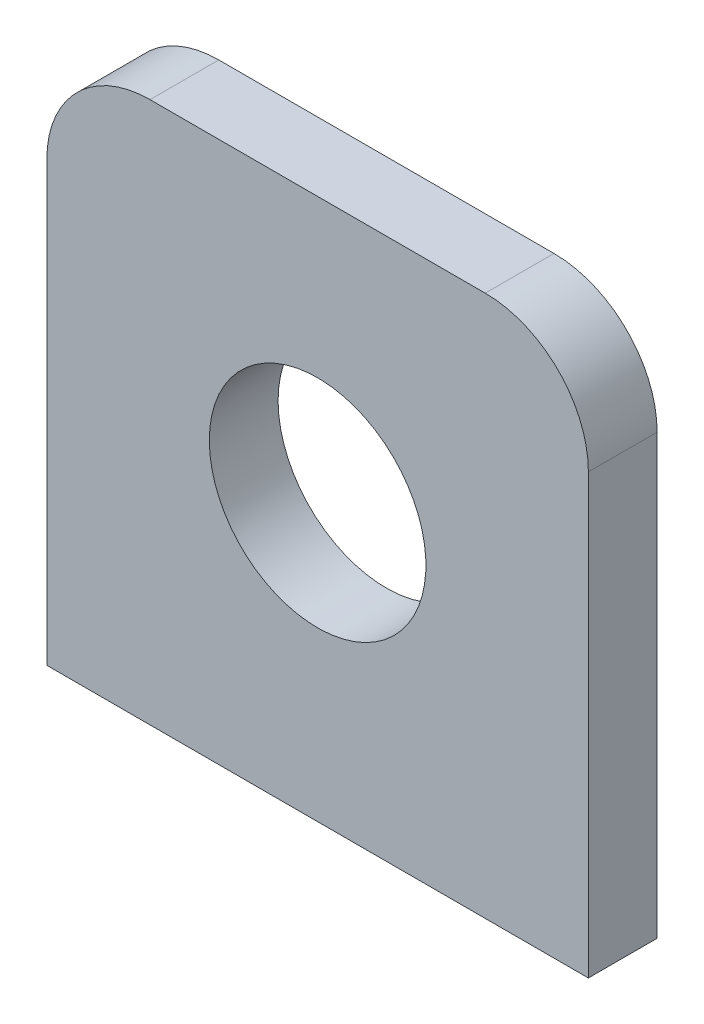
ISO-10303-21;
HEADER;
FILE_DESCRIPTION(('STEP AP214'),'2;1');
FILE_NAME('part.step','',(''),(''),'','','');
FILE_SCHEMA(('AUTOMOTIVE_DESIGN { 1 0 10303 214 1 1 1 1 }'));
ENDSEC;
DATA;
#1=APPLICATION_CONTEXT('core data for automotive mechanical design processes');
#2=APPLICATION_PROTOCOL_DEFINITION('international standard','automotive_design',2000,#1);
#3=PRODUCT_CONTEXT('',#1,'mechanical');
#4=PRODUCT('Part','Part','',(#3));
#5=PRODUCT_RELATED_PRODUCT_CATEGORY('part','',(#4));
#6=PRODUCT_DEFINITION_FORMATION('','',#4);
#7=PRODUCT_DEFINITION_CONTEXT('part definition',#1,'design');
#8=PRODUCT_DEFINITION('design','',#6,#7);
#9=PRODUCT_DEFINITION_SHAPE('','',#8);
#10=(LENGTH_UNIT() NAMED_UNIT(*) SI_UNIT(.MILLI.,.METRE.));
#11=(NAMED_UNIT(*) PLANE_ANGLE_UNIT() SI_UNIT($,.RADIAN.));
#12=(NAMED_UNIT(*) SI_UNIT($,.STERADIAN.) SOLID_ANGLE_UNIT());
#13=UNCERTAINTY_MEASURE_WITH_UNIT(LENGTH_MEASURE(1.E-05),#10,'distance_accuracy_value','');
#14=(GEOMETRIC_REPRESENTATION_CONTEXT(3) GLOBAL_UNCERTAINTY_ASSIGNED_CONTEXT((#13)) GLOBAL_UNIT_ASSIGNED_CONTEXT((#10,
#11,#12)) REPRESENTATION_CONTEXT('',''));
#15=CARTESIAN_POINT('',(0.,0.,0.));
#16=DIRECTION('',(0.,0.,1.));
#17=DIRECTION('',(1.,0.,0.));
#18=AXIS2_PLACEMENT_3D('',#15,#16,#17);
#19=CARTESIAN_POINT('',(-13.,0.,0.));
#20=DIRECTION('',(0.,-1.,0.));
#21=DIRECTION('',(0.,0.,-1.));
#22=AXIS2_PLACEMENT_3D('',#19,#20,#21);
#23=PLANE('',#22);
#24=CARTESIAN_POINT('',(-5.5,0.,3.175));
#25=DIRECTION('',(0.,-1.,0.));
#26=DIRECTION('',(0.,0.,-1.));
#27=AXIS2_PLACEMENT_3D('',#24,#25,#26);
#28=CIRCLE('',#27,1.64999999999999);
#29=CARTESIAN_POINT('',(-5.5,0.,1.52500000000001));
#30=VERTEX_POINT('',#29);
#31=EDGE_CURVE('E104',#30,#30,#28,.T.);
#32=ORIENTED_EDGE('',*,*,#31,.F.);
#33=EDGE_LOOP('',(#32));
#34=FACE_BOUND('',#33,.T.);
#35=CARTESIAN_POINT('',(29.5,0.,3.175));
#36=DIRECTION('',(0.,-1.,0.));
#37=DIRECTION('',(0.,0.,-1.));
#38=AXIS2_PLACEMENT_3D('',#35,#36,#37);
#39=CIRCLE('',#38,1.64999999999999);
#40=CARTESIAN_POINT('',(29.5,0.,1.52500000000001));
#41=VERTEX_POINT('',#40);
#42=EDGE_CURVE('E103',#41,#41,#39,.T.);
#43=ORIENTED_EDGE('',*,*,#42,.F.);
#44=EDGE_LOOP('',(#43));
#45=FACE_BOUND('',#44,.T.);
#46=DIRECTION('',(1.,0.,0.));
#47=VECTOR('',#46,1.);
#48=CARTESIAN_POINT('',(-13.,0.,6.35));
#49=LINE('',#48,#47);
#50=CARTESIAN_POINT('',(-13.,0.,6.35));
#51=VERTEX_POINT('',#50);
#52=CARTESIAN_POINT('',(37.,0.,6.35));
#53=VERTEX_POINT('',#52);
#54=EDGE_CURVE('E120',#51,#53,#49,.T.);
#55=ORIENTED_EDGE('',*,*,#54,.F.);
#56=DIRECTION('',(0.,0.,1.));
#57=VECTOR('',#56,1.);
#58=CARTESIAN_POINT('',(-13.,0.,0.));
#59=LINE('',#58,#57);
#60=CARTESIAN_POINT('',(-13.,0.,0.));
#61=VERTEX_POINT('',#60);
#62=EDGE_CURVE('E142',#61,#51,#59,.T.);
#63=ORIENTED_EDGE('',*,*,#62,.F.);
#64=DIRECTION('',(1.,0.,0.));
#65=VECTOR('',#64,1.);
#66=CARTESIAN_POINT('',(-13.,0.,0.));
#67=LINE('',#66,#65);
#68=CARTESIAN_POINT('',(37.,0.,0.));
#69=VERTEX_POINT('',#68);
#70=EDGE_CURVE('E121',#61,#69,#67,.T.);
#71=ORIENTED_EDGE('',*,*,#70,.T.);
#72=DIRECTION('',(0.,0.,1.));
#73=VECTOR('',#72,1.);
#74=CARTESIAN_POINT('',(37.,0.,0.));
#75=LINE('',#74,#73);
#76=EDGE_CURVE('E132',#69,#53,#75,.T.);
#77=ORIENTED_EDGE('',*,*,#76,.T.);
#78=EDGE_LOOP('',(#55,#63,#71,#77));
#79=FACE_BOUND('',#78,.T.);
#80=ADVANCED_FACE('F33',(#34,#45,#79),#23,.T.);
#81=CARTESIAN_POINT('',(-13.,50.,0.));
#82=DIRECTION('',(-1.,0.,0.));
#83=DIRECTION('',(0.,0.,1.));
#84=AXIS2_PLACEMENT_3D('',#81,#82,#83);
#85=PLANE('',#84);
#86=DIRECTION('',(0.,-1.,0.));
#87=VECTOR('',#86,1.);
#88=CARTESIAN_POINT('',(-13.,50.,6.35));
#89=LINE('',#88,#87);
#90=CARTESIAN_POINT('',(-13.,40.475,6.35));
#91=VERTEX_POINT('',#90);
#92=EDGE_CURVE('E125',#91,#51,#89,.T.);
#93=ORIENTED_EDGE('',*,*,#92,.F.);
#94=DIRECTION('',(0.,0.,1.));
#95=VECTOR('',#94,1.);
#96=CARTESIAN_POINT('',(-13.,40.475,0.));
#97=LINE('',#96,#95);
#98=CARTESIAN_POINT('',(-13.,40.475,0.));
#99=VERTEX_POINT('',#98);
#100=EDGE_CURVE('E56',#91,#99,#97,.F.);
#101=ORIENTED_EDGE('',*,*,#100,.T.);
#102=DIRECTION('',(0.,-1.,0.));
#103=VECTOR('',#102,1.);
#104=CARTESIAN_POINT('',(-13.,50.,0.));
#105=LINE('',#104,#103);
#106=EDGE_CURVE('E130',#99,#61,#105,.T.);
#107=ORIENTED_EDGE('',*,*,#106,.T.);
#108=ORIENTED_EDGE('',*,*,#62,.T.);
#109=EDGE_LOOP('',(#93,#101,#107,#108));
#110=FACE_BOUND('',#109,.T.);
#111=ADVANCED_FACE('F168',(#110),#85,.T.);
#112=CARTESIAN_POINT('',(37.,50.,0.));
#113=DIRECTION('',(0.,1.,0.));
#114=DIRECTION('',(-1.,0.,0.));
#115=AXIS2_PLACEMENT_3D('',#112,#113,#114);
#116=PLANE('',#115);
#117=DIRECTION('',(-1.,0.,0.));
#118=VECTOR('',#117,1.);
#119=CARTESIAN_POINT('',(37.,50.,0.));
#120=LINE('',#119,#118);
#121=CARTESIAN_POINT('',(27.475,50.,0.));
#122=VERTEX_POINT('',#121);
#123=CARTESIAN_POINT('',(-3.47500000000001,50.,0.));
#124=VERTEX_POINT('',#123);
#125=EDGE_CURVE('E127',#122,#124,#120,.T.);
#126=ORIENTED_EDGE('',*,*,#125,.T.);
#127=DIRECTION('',(0.,0.,1.));
#128=VECTOR('',#127,1.);
#129=CARTESIAN_POINT('',(-3.47500000000001,50.,0.));
#130=LINE('',#129,#128);
#131=CARTESIAN_POINT('',(-3.47500000000001,50.,6.35));
#132=VERTEX_POINT('',#131);
#133=EDGE_CURVE('E148',#124,#132,#130,.T.);
#134=ORIENTED_EDGE('',*,*,#133,.T.);
#135=DIRECTION('',(-1.,0.,0.));
#136=VECTOR('',#135,1.);
#137=CARTESIAN_POINT('',(37.,50.,6.35));
#138=LINE('',#137,#136);
#139=CARTESIAN_POINT('',(27.475,50.,6.35));
#140=VERTEX_POINT('',#139);
#141=EDGE_CURVE('E138',#140,#132,#138,.T.);
#142=ORIENTED_EDGE('',*,*,#141,.F.);
#143=DIRECTION('',(0.,0.,1.));
#144=VECTOR('',#143,1.);
#145=CARTESIAN_POINT('',(27.475,50.,0.));
#146=LINE('',#145,#144);
#147=EDGE_CURVE('E145',#140,#122,#146,.F.);
#148=ORIENTED_EDGE('',*,*,#147,.T.);
#149=EDGE_LOOP('',(#126,#134,#142,#148));
#150=FACE_BOUND('',#149,.T.);
#151=ADVANCED_FACE('F162',(#150),#116,.T.);
#152=CARTESIAN_POINT('',(37.,0.,0.));
#153=DIRECTION('',(1.,0.,0.));
#154=DIRECTION('',(0.,0.,-1.));
#155=AXIS2_PLACEMENT_3D('',#152,#153,#154);
#156=PLANE('',#155);
#157=DIRECTION('',(0.,1.,0.));
#158=VECTOR('',#157,1.);
#159=CARTESIAN_POINT('',(37.,0.,0.));
#160=LINE('',#159,#158);
#161=CARTESIAN_POINT('',(37.,40.475,0.));
#162=VERTEX_POINT('',#161);
#163=EDGE_CURVE('E124',#69,#162,#160,.T.);
#164=ORIENTED_EDGE('',*,*,#163,.T.);
#165=DIRECTION('',(0.,0.,1.));
#166=VECTOR('',#165,1.);
#167=CARTESIAN_POINT('',(37.,40.475,0.));
#168=LINE('',#167,#166);
#169=CARTESIAN_POINT('',(37.,40.475,6.35));
#170=VERTEX_POINT('',#169);
#171=EDGE_CURVE('E11',#162,#170,#168,.T.);
#172=ORIENTED_EDGE('',*,*,#171,.T.);
#173=DIRECTION('',(0.,1.,0.));
#174=VECTOR('',#173,1.);
#175=CARTESIAN_POINT('',(37.,0.,6.35));
#176=LINE('',#175,#174);
#177=EDGE_CURVE('E135',#53,#170,#176,.T.);
#178=ORIENTED_EDGE('',*,*,#177,.F.);
#179=ORIENTED_EDGE('',*,*,#76,.F.);
#180=EDGE_LOOP('',(#164,#172,#178,#179));
#181=FACE_BOUND('',#180,.T.);
#182=ADVANCED_FACE('F174',(#181),#156,.T.);
#183=CARTESIAN_POINT('',(0.,0.,0.));
#184=DIRECTION('',(0.,0.,1.));
#185=DIRECTION('',(1.,0.,0.));
#186=AXIS2_PLACEMENT_3D('',#183,#184,#185);
#187=PLANE('',#186);
#188=CARTESIAN_POINT('',(12.,25.5,0.));
#189=DIRECTION('',(0.,0.,-1.));
#190=DIRECTION('',(-1.,0.,0.));
#191=AXIS2_PLACEMENT_3D('',#188,#189,#190);
#192=CIRCLE('',#191,10.);
#193=CARTESIAN_POINT('',(2.,25.5,0.));
#194=VERTEX_POINT('',#193);
#195=EDGE_CURVE('E114',#194,#194,#192,.T.);
#196=ORIENTED_EDGE('',*,*,#195,.F.);
#197=EDGE_LOOP('',(#196));
#198=FACE_BOUND('',#197,.T.);
#199=ORIENTED_EDGE('',*,*,#106,.F.);
#200=CARTESIAN_POINT('',(-3.47500000000001,40.475,0.));
#201=DIRECTION('',(0.,0.,1.));
#202=DIRECTION('',(1.,0.,0.));
#203=AXIS2_PLACEMENT_3D('',#200,#201,#202);
#204=CIRCLE('',#203,9.525);
#205=EDGE_CURVE('E41',#99,#124,#204,.F.);
#206=ORIENTED_EDGE('',*,*,#205,.T.);
#207=ORIENTED_EDGE('',*,*,#125,.F.);
#208=CARTESIAN_POINT('',(27.475,40.475,0.));
#209=DIRECTION('',(0.,0.,1.));
#210=DIRECTION('',(1.,0.,0.));
#211=AXIS2_PLACEMENT_3D('',#208,#209,#210);
#212=CIRCLE('',#211,9.525);
#213=EDGE_CURVE('E48',#122,#162,#212,.F.);
#214=ORIENTED_EDGE('',*,*,#213,.T.);
#215=ORIENTED_EDGE('',*,*,#163,.F.);
#216=ORIENTED_EDGE('',*,*,#70,.F.);
#217=EDGE_LOOP('',(#199,#206,#207,#214,#215,#216));
#218=FACE_BOUND('',#217,.T.);
#219=ADVANCED_FACE('F157',(#198,#218),#187,.F.);
#220=CARTESIAN_POINT('',(0.,0.,6.35));
#221=DIRECTION('',(0.,0.,1.));
#222=DIRECTION('',(1.,0.,0.));
#223=AXIS2_PLACEMENT_3D('',#220,#221,#222);
#224=PLANE('',#223);
#225=CARTESIAN_POINT('',(12.,25.5,6.35));
#226=DIRECTION('',(0.,0.,-1.));
#227=DIRECTION('',(-1.,0.,0.));
#228=AXIS2_PLACEMENT_3D('',#225,#226,#227);
#229=CIRCLE('',#228,10.);
#230=CARTESIAN_POINT('',(2.,25.5,6.35));
#231=VERTEX_POINT('',#230);
#232=EDGE_CURVE('E117',#231,#231,#229,.T.);
#233=ORIENTED_EDGE('',*,*,#232,.T.);
#234=EDGE_LOOP('',(#233));
#235=FACE_BOUND('',#234,.T.);
#236=ORIENTED_EDGE('',*,*,#141,.T.);
#237=CARTESIAN_POINT('',(-3.47500000000001,40.475,6.35));
#238=DIRECTION('',(0.,0.,1.));
#239=DIRECTION('',(1.,0.,0.));
#240=AXIS2_PLACEMENT_3D('',#237,#238,#239);
#241=CIRCLE('',#240,9.525);
#242=EDGE_CURVE('E153',#132,#91,#241,.T.);
#243=ORIENTED_EDGE('',*,*,#242,.T.);
#244=ORIENTED_EDGE('',*,*,#92,.T.);
#245=ORIENTED_EDGE('',*,*,#54,.T.);
#246=ORIENTED_EDGE('',*,*,#177,.T.);
#247=CARTESIAN_POINT('',(27.475,40.475,6.35));
#248=DIRECTION('',(0.,0.,1.));
#249=DIRECTION('',(1.,0.,0.));
#250=AXIS2_PLACEMENT_3D('',#247,#248,#249);
#251=CIRCLE('',#250,9.525);
#252=EDGE_CURVE('E151',#170,#140,#251,.T.);
#253=ORIENTED_EDGE('',*,*,#252,.T.);
#254=EDGE_LOOP('',(#236,#243,#244,#245,#246,#253));
#255=FACE_BOUND('',#254,.T.);
#256=ADVANCED_FACE('F167',(#235,#255),#224,.T.);
#257=CARTESIAN_POINT('',(12.,25.5,0.));
#258=DIRECTION('',(0.,0.,-1.));
#259=DIRECTION('',(-1.,0.,0.));
#260=AXIS2_PLACEMENT_3D('',#257,#258,#259);
#261=CYLINDRICAL_SURFACE('',#260,10.);
#262=ORIENTED_EDGE('',*,*,#232,.F.);
#263=EDGE_LOOP('',(#262));
#264=FACE_BOUND('',#263,.T.);
#265=ORIENTED_EDGE('',*,*,#195,.T.);
#266=EDGE_LOOP('',(#265));
#267=FACE_BOUND('',#266,.T.);
#268=ADVANCED_FACE('F197',(#264,#267),#261,.F.);
#269=CARTESIAN_POINT('',(29.5,9.1,3.175));
#270=DIRECTION('',(0.,-1.,0.));
#271=DIRECTION('',(0.,0.,-1.));
#272=AXIS2_PLACEMENT_3D('',#269,#270,#271);
#273=CONICAL_SURFACE('',#272,1.64999999999999,1.02974425867665);
#274=CARTESIAN_POINT('',(29.5,10.0914200213955,3.175));
#275=VERTEX_POINT('',#274);
#276=VERTEX_LOOP('',#275);
#277=FACE_BOUND('',#276,.T.);
#278=CARTESIAN_POINT('',(29.5,9.1,3.175));
#279=DIRECTION('',(0.,-1.,0.));
#280=DIRECTION('',(0.,0.,-1.));
#281=AXIS2_PLACEMENT_3D('',#278,#279,#280);
#282=CIRCLE('',#281,1.64999999999999);
#283=CARTESIAN_POINT('',(29.5,9.1,1.52500000000001));
#284=VERTEX_POINT('',#283);
#285=EDGE_CURVE('E107',#284,#284,#282,.T.);
#286=ORIENTED_EDGE('',*,*,#285,.T.);
#287=EDGE_LOOP('',(#286));
#288=FACE_BOUND('',#287,.T.);
#289=ADVANCED_FACE('F204',(#277,#288),#273,.F.);
#290=CARTESIAN_POINT('',(29.5,0.,3.175));
#291=DIRECTION('',(0.,-1.,0.));
#292=DIRECTION('',(0.,0.,-1.));
#293=AXIS2_PLACEMENT_3D('',#290,#291,#292);
#294=CYLINDRICAL_SURFACE('',#293,1.64999999999999);
#295=ORIENTED_EDGE('',*,*,#285,.F.);
#296=EDGE_LOOP('',(#295));
#297=FACE_BOUND('',#296,.T.);
#298=ORIENTED_EDGE('',*,*,#42,.T.);
#299=EDGE_LOOP('',(#298));
#300=FACE_BOUND('',#299,.T.);
#301=ADVANCED_FACE('F97',(#297,#300),#294,.F.);
#302=CARTESIAN_POINT('',(-5.5,9.1,3.175));
#303=DIRECTION('',(0.,-1.,0.));
#304=DIRECTION('',(0.,0.,-1.));
#305=AXIS2_PLACEMENT_3D('',#302,#303,#304);
#306=CONICAL_SURFACE('',#305,1.64999999999999,1.02974425867665);
#307=CARTESIAN_POINT('',(-5.5,10.0914200213955,3.175));
#308=VERTEX_POINT('',#307);
#309=VERTEX_LOOP('',#308);
#310=FACE_BOUND('',#309,.T.);
#311=CARTESIAN_POINT('',(-5.5,9.1,3.175));
#312=DIRECTION('',(0.,-1.,0.));
#313=DIRECTION('',(0.,0.,-1.));
#314=AXIS2_PLACEMENT_3D('',#311,#312,#313);
#315=CIRCLE('',#314,1.64999999999999);
#316=CARTESIAN_POINT('',(-5.5,9.1,1.52500000000001));
#317=VERTEX_POINT('',#316);
#318=EDGE_CURVE('E101',#317,#317,#315,.T.);
#319=ORIENTED_EDGE('',*,*,#318,.T.);
#320=EDGE_LOOP('',(#319));
#321=FACE_BOUND('',#320,.T.);
#322=ADVANCED_FACE('F93',(#310,#321),#306,.F.);
#323=CARTESIAN_POINT('',(-5.5,0.,3.175));
#324=DIRECTION('',(0.,-1.,0.));
#325=DIRECTION('',(0.,0.,-1.));
#326=AXIS2_PLACEMENT_3D('',#323,#324,#325);
#327=CYLINDRICAL_SURFACE('',#326,1.64999999999999);
#328=ORIENTED_EDGE('',*,*,#318,.F.);
#329=EDGE_LOOP('',(#328));
#330=FACE_BOUND('',#329,.T.);
#331=ORIENTED_EDGE('',*,*,#31,.T.);
#332=EDGE_LOOP('',(#331));
#333=FACE_BOUND('',#332,.T.);
#334=ADVANCED_FACE('F96',(#330,#333),#327,.F.);
#335=CARTESIAN_POINT('',(-3.47500000000001,40.475,0.));
#336=DIRECTION('',(0.,0.,1.));
#337=DIRECTION('',(1.,0.,0.));
#338=AXIS2_PLACEMENT_3D('',#335,#336,#337);
#339=CYLINDRICAL_SURFACE('',#338,9.525);
#340=ORIENTED_EDGE('',*,*,#205,.F.);
#341=ORIENTED_EDGE('',*,*,#100,.F.);
#342=ORIENTED_EDGE('',*,*,#242,.F.);
#343=ORIENTED_EDGE('',*,*,#133,.F.);
#344=EDGE_LOOP('',(#340,#341,#342,#343));
#345=FACE_BOUND('',#344,.T.);
#346=ADVANCED_FACE('F165',(#345),#339,.T.);
#347=CARTESIAN_POINT('',(27.475,40.475,0.));
#348=DIRECTION('',(0.,0.,1.));
#349=DIRECTION('',(1.,0.,0.));
#350=AXIS2_PLACEMENT_3D('',#347,#348,#349);
#351=CYLINDRICAL_SURFACE('',#350,9.525);
#352=ORIENTED_EDGE('',*,*,#213,.F.);
#353=ORIENTED_EDGE('',*,*,#147,.F.);
#354=ORIENTED_EDGE('',*,*,#252,.F.);
#355=ORIENTED_EDGE('',*,*,#171,.F.);
#356=EDGE_LOOP('',(#352,#353,#354,#355));
#357=FACE_BOUND('',#356,.T.);
#358=ADVANCED_FACE('F35',(#357),#351,.T.);
#359=CLOSED_SHELL('',(#80,#111,#151,#182,#219,#256,#268,#289,#301,#322,#334,#346,#358));
#360=MANIFOLD_SOLID_BREP('B2',#359);
#361=ADVANCED_BREP_SHAPE_REPRESENTATION('',(#18,#360),#14);
#362=SHAPE_DEFINITION_REPRESENTATION(#9,#361);
ENDSEC;
END-ISO-10303-21;
